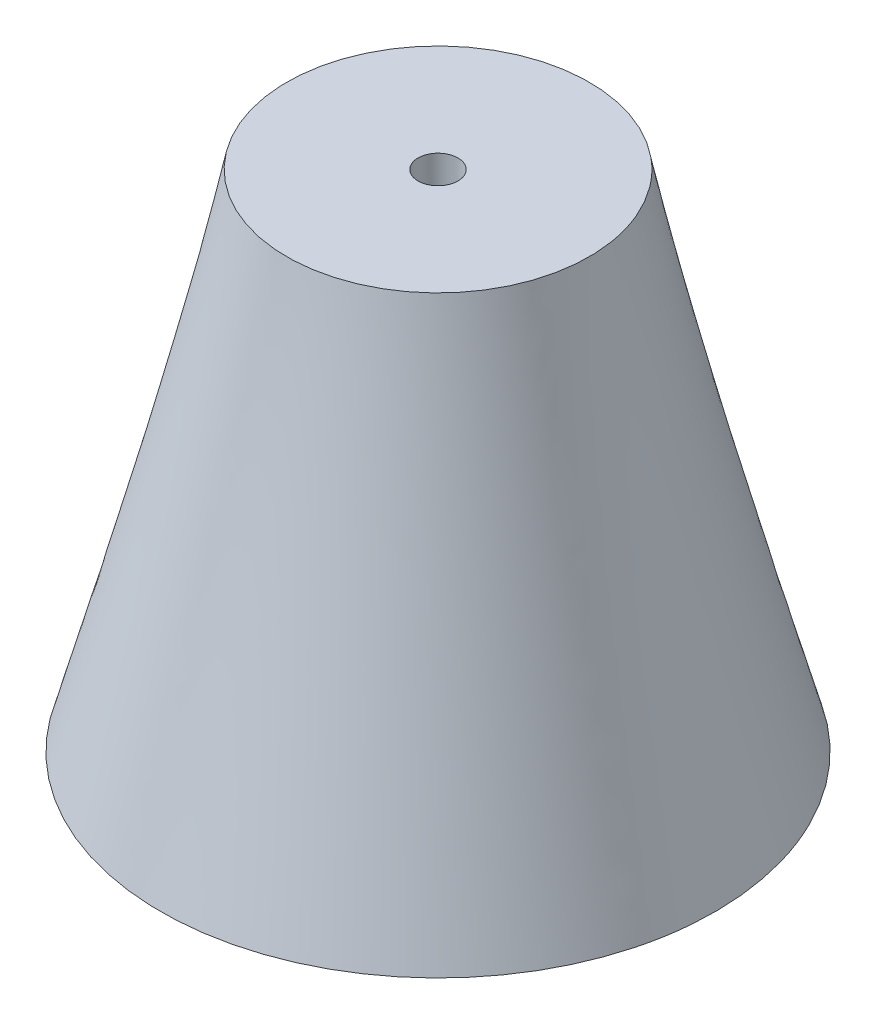
ISO-10303-21;
HEADER;
FILE_DESCRIPTION(('STEP AP214'),'2;1');
FILE_NAME('part.step','',(''),(''),'','','');
FILE_SCHEMA(('AUTOMOTIVE_DESIGN { 1 0 10303 214 1 1 1 1 }'));
ENDSEC;
DATA;
#1=APPLICATION_CONTEXT('core data for automotive mechanical design processes');
#2=APPLICATION_PROTOCOL_DEFINITION('international standard','automotive_design',2000,#1);
#3=PRODUCT_CONTEXT('',#1,'mechanical');
#4=PRODUCT('Part','Part','',(#3));
#5=PRODUCT_RELATED_PRODUCT_CATEGORY('part','',(#4));
#6=PRODUCT_DEFINITION_FORMATION('','',#4);
#7=PRODUCT_DEFINITION_CONTEXT('part definition',#1,'design');
#8=PRODUCT_DEFINITION('design','',#6,#7);
#9=PRODUCT_DEFINITION_SHAPE('','',#8);
#10=(LENGTH_UNIT() NAMED_UNIT(*) SI_UNIT(.MILLI.,.METRE.));
#11=(NAMED_UNIT(*) PLANE_ANGLE_UNIT() SI_UNIT($,.RADIAN.));
#12=(NAMED_UNIT(*) SI_UNIT($,.STERADIAN.) SOLID_ANGLE_UNIT());
#13=UNCERTAINTY_MEASURE_WITH_UNIT(LENGTH_MEASURE(1.E-05),#10,'distance_accuracy_value','');
#14=(GEOMETRIC_REPRESENTATION_CONTEXT(3) GLOBAL_UNCERTAINTY_ASSIGNED_CONTEXT((#13)) GLOBAL_UNIT_ASSIGNED_CONTEXT((#10,
#11,#12)) REPRESENTATION_CONTEXT('',''));
#15=CARTESIAN_POINT('',(0.,0.,0.));
#16=DIRECTION('',(0.,0.,1.));
#17=DIRECTION('',(1.,0.,0.));
#18=AXIS2_PLACEMENT_3D('',#15,#16,#17);
#19=CARTESIAN_POINT('',(3.49148133884313E-13,50.,0.));
#20=DIRECTION('',(0.,-1.,0.));
#21=DIRECTION('',(1.,0.,0.));
#22=AXIS2_PLACEMENT_3D('',#19,#20,#21);
#23=PLANE('',#22);
#24=CARTESIAN_POINT('',(3.49148133884313E-13,50.,0.));
#25=DIRECTION('',(0.,-1.,0.));
#26=DIRECTION('',(1.,0.,0.));
#27=AXIS2_PLACEMENT_3D('',#24,#25,#26);
#28=CIRCLE('',#27,1.98019100000033);
#29=CARTESIAN_POINT('',(1.98019100000068,50.,0.));
#30=VERTEX_POINT('',#29);
#31=EDGE_CURVE('E115',#30,#30,#28,.T.);
#32=ORIENTED_EDGE('',*,*,#31,.T.);
#33=EDGE_LOOP('',(#32));
#34=FACE_BOUND('',#33,.T.);
#35=CARTESIAN_POINT('',(3.49148133884313E-13,50.,0.));
#36=DIRECTION('',(0.,-1.,0.));
#37=DIRECTION('',(1.,0.,0.));
#38=AXIS2_PLACEMENT_3D('',#35,#36,#37);
#39=CIRCLE('',#38,15.0000000000003);
#40=CARTESIAN_POINT('',(-13.0154408138258,50.0000000000001,7.45642678645742));
#41=VERTEX_POINT('',#40);
#42=EDGE_CURVE('E11',#41,#41,#39,.T.);
#43=ORIENTED_EDGE('',*,*,#42,.F.);
#44=EDGE_LOOP('',(#43));
#45=FACE_BOUND('',#44,.T.);
#46=ADVANCED_FACE('F40',(#34,#45),#23,.F.);
#47=CARTESIAN_POINT('',(0.,0.,0.));
#48=DIRECTION('',(0.,1.,0.));
#49=DIRECTION('',(0.,0.,1.));
#50=AXIS2_PLACEMENT_3D('',#47,#48,#49);
#51=PLANE('',#50);
#52=CARTESIAN_POINT('',(0.,0.,0.));
#53=DIRECTION('',(0.,1.,0.));
#54=DIRECTION('',(0.,0.,1.));
#55=AXIS2_PLACEMENT_3D('',#52,#53,#54);
#56=CIRCLE('',#55,27.5);
#57=CARTESIAN_POINT('',(-27.3645996144622,0.,2.7255619494291));
#58=VERTEX_POINT('',#57);
#59=EDGE_CURVE('E48',#58,#58,#56,.T.);
#60=ORIENTED_EDGE('',*,*,#59,.F.);
#61=EDGE_LOOP('',(#60));
#62=FACE_BOUND('',#61,.T.);
#63=ADVANCED_FACE('F74',(#62),#51,.F.);
#64=CARTESIAN_POINT('',(-27.3645996144622,0.,2.7255619494291));
#65=CARTESIAN_POINT('',(-13.0154408138258,50.0000000000001,7.45642678645742));
#66=CARTESIAN_POINT('',(-21.913475715604,0.,57.4547611783535));
#67=CARTESIAN_POINT('',(1.89741275908908,50.,33.4873084141096));
#68=CARTESIAN_POINT('',(32.8157235133204,0.,52.0036372794953));
#69=CARTESIAN_POINT('',(27.9282943867413,49.9999999999998,18.5744548411948));
#70=CARTESIAN_POINT('',(27.3645996144622,0.,-2.7255619494291));
#71=CARTESIAN_POINT('',(13.0154408138264,49.9999999999999,-7.45642678645742));
#72=CARTESIAN_POINT('',(21.913475715604,0.,-57.4547611783535));
#73=CARTESIAN_POINT('',(-1.8974127590884,50.,-33.4873084141096));
#74=CARTESIAN_POINT('',(-32.8157235133204,0.,-52.0036372794953));
#75=CARTESIAN_POINT('',(-27.9282943867406,50.0000000000002,-18.5744548411948));
#76=CARTESIAN_POINT('',(-27.3645996144622,0.,2.7255619494291));
#77=CARTESIAN_POINT('',(-13.0154408138258,50.0000000000001,7.45642678645742));
#78=(BOUNDED_SURFACE() B_SPLINE_SURFACE(3,1,((#64,#65),(#66,#67),(#68,#69),(#70,#71),(#72,#73),
(#74,#75),(#76,#77)),.UNSPECIFIED.,.T.,.F.,.F.) B_SPLINE_SURFACE_WITH_KNOTS((4,3,4),(2,2),(0.,
0.5,1.),(0.,1.),.UNSPECIFIED.) GEOMETRIC_REPRESENTATION_ITEM() RATIONAL_B_SPLINE_SURFACE(((1.,
1.),(0.333333333333333,0.333333333333333),(0.333333333333333,0.333333333333333),(1.,1.),
(0.333333333333333,0.333333333333333),(0.333333333333333,0.333333333333333),(1.,1.))) REPRESENTATION_ITEM('') SURFACE());
#79=CARTESIAN_POINT('',(-27.3645996144622,0.,2.7255619494291));
#80=CARTESIAN_POINT('',(-27.2151292102889,0.520833333333334,2.77484179148148));
#81=CARTESIAN_POINT('',(-27.0656588061156,1.04166666666667,2.82412163353385));
#82=CARTESIAN_POINT('',(-26.766717997769,2.08333333333334,2.92268131763861));
#83=CARTESIAN_POINT('',(-26.6172475935957,2.60416666666667,2.97196115969099));
#84=CARTESIAN_POINT('',(-26.3183067852491,3.64583333333334,3.07052084379575));
#85=CARTESIAN_POINT('',(-26.1688363810758,4.16666666666667,3.11980068584813));
#86=CARTESIAN_POINT('',(-25.8698955727292,5.20833333333334,3.21836036995288));
#87=CARTESIAN_POINT('',(-25.7204251685559,5.72916666666668,3.26764021200526));
#88=CARTESIAN_POINT('',(-25.4214843602093,6.77083333333335,3.36619989611002));
#89=CARTESIAN_POINT('',(-25.272013956036,7.29166666666668,3.41547973816239));
#90=CARTESIAN_POINT('',(-24.9730731476894,8.33333333333335,3.51403942226715));
#91=CARTESIAN_POINT('',(-24.8236027435162,8.85416666666668,3.56331926431953));
#92=CARTESIAN_POINT('',(-24.5246619351696,9.89583333333335,3.66187894842429));
#93=CARTESIAN_POINT('',(-24.3751915309963,10.4166666666667,3.71115879047667));
#94=CARTESIAN_POINT('',(-24.0762507226497,11.4583333333334,3.80971847458142));
#95=CARTESIAN_POINT('',(-23.9267803184764,11.9791666666667,3.8589983166338));
#96=CARTESIAN_POINT('',(-23.6278395101298,13.0208333333334,3.95755800073856));
#97=CARTESIAN_POINT('',(-23.4783691059565,13.5416666666667,4.00683784279093));
#98=CARTESIAN_POINT('',(-23.1794282976099,14.5833333333334,4.10539752689569));
#99=CARTESIAN_POINT('',(-23.0299578934366,15.1041666666667,4.15467736894807));
#100=CARTESIAN_POINT('',(-22.73101708509,16.1458333333334,4.25323705305283));
#101=CARTESIAN_POINT('',(-22.5815466809167,16.6666666666667,4.3025168951052));
#102=CARTESIAN_POINT('',(-22.2826058725701,17.7083333333334,4.40107657920996));
#103=CARTESIAN_POINT('',(-22.1331354683968,18.2291666666667,4.45035642126234));
#104=CARTESIAN_POINT('',(-21.8341946600502,19.2708333333334,4.5489161053671));
#105=CARTESIAN_POINT('',(-21.6847242558769,19.7916666666667,4.59819594741947));
#106=CARTESIAN_POINT('',(-21.3857834475303,20.8333333333334,4.69675563152423));
#107=CARTESIAN_POINT('',(-21.236313043357,21.3541666666667,4.74603547357661));
#108=CARTESIAN_POINT('',(-20.9373722350105,22.3958333333334,4.84459515768137));
#109=CARTESIAN_POINT('',(-20.7879018308372,22.9166666666667,4.89387499973374));
#110=CARTESIAN_POINT('',(-20.4889610224906,23.9583333333334,4.9924346838385));
#111=CARTESIAN_POINT('',(-20.3394906183173,24.4791666666667,5.04171452589088));
#112=CARTESIAN_POINT('',(-20.0405498099707,25.5208333333334,5.14027420999564));
#113=CARTESIAN_POINT('',(-19.8910794057974,26.0416666666667,5.18955405204802));
#114=CARTESIAN_POINT('',(-19.5921385974508,27.0833333333334,5.28811373615277));
#115=CARTESIAN_POINT('',(-19.4426681932775,27.6041666666667,5.33739357820515));
#116=CARTESIAN_POINT('',(-19.1437273849309,28.6458333333334,5.43595326230991));
#117=CARTESIAN_POINT('',(-18.9942569807576,29.1666666666667,5.48523310436229));
#118=CARTESIAN_POINT('',(-18.695316172411,30.2083333333334,5.58379278846704));
#119=CARTESIAN_POINT('',(-18.5458457682377,30.7291666666667,5.63307263051942));
#120=CARTESIAN_POINT('',(-18.2469049598911,31.7708333333334,5.73163231462418));
#121=CARTESIAN_POINT('',(-18.0974345557178,32.2916666666667,5.78091215667656));
#122=CARTESIAN_POINT('',(-17.7984937473712,33.3333333333334,5.87947184078131));
#123=CARTESIAN_POINT('',(-17.6490233431979,33.8541666666667,5.92875168283369));
#124=CARTESIAN_POINT('',(-17.3500825348513,34.8958333333334,6.02731136693845));
#125=CARTESIAN_POINT('',(-17.200612130678,35.4166666666667,6.07659120899083));
#126=CARTESIAN_POINT('',(-16.9016713223315,36.4583333333334,6.17515089309558));
#127=CARTESIAN_POINT('',(-16.7522009181582,36.9791666666667,6.22443073514796));
#128=CARTESIAN_POINT('',(-16.4532601098116,38.0208333333334,6.32299041925272));
#129=CARTESIAN_POINT('',(-16.3037897056383,38.5416666666667,6.3722702613051));
#130=CARTESIAN_POINT('',(-16.0048488972917,39.5833333333334,6.47082994540985));
#131=CARTESIAN_POINT('',(-15.8553784931184,40.1041666666667,6.52010978746223));
#132=CARTESIAN_POINT('',(-15.5564376847718,41.1458333333334,6.61866947156699));
#133=CARTESIAN_POINT('',(-15.4069672805985,41.6666666666667,6.66794931361937));
#134=CARTESIAN_POINT('',(-15.1080264722519,42.7083333333334,6.76650899772412));
#135=CARTESIAN_POINT('',(-14.9585560680786,43.2291666666667,6.8157888397765));
#136=CARTESIAN_POINT('',(-14.659615259732,44.2708333333334,6.91434852388126));
#137=CARTESIAN_POINT('',(-14.5101448555587,44.7916666666667,6.96362836593364));
#138=CARTESIAN_POINT('',(-14.2112040472121,45.8333333333334,7.06218805003839));
#139=CARTESIAN_POINT('',(-14.0617336430388,46.3541666666667,7.11146789209077));
#140=CARTESIAN_POINT('',(-13.7627928346922,47.3958333333334,7.21002757619553));
#141=CARTESIAN_POINT('',(-13.6133224305189,47.9166666666668,7.25930741824791));
#142=CARTESIAN_POINT('',(-13.3143816221723,48.9583333333334,7.35786710235266));
#143=CARTESIAN_POINT('',(-13.164911217999,49.4791666666668,7.40714694440504));
#144=CARTESIAN_POINT('',(-13.0154408138258,50.0000000000001,7.45642678645742));
#145=B_SPLINE_CURVE_WITH_KNOTS('',3,(#79,#80,#81,#82,#83,#84,#85,#86,#87,#88,#89,#90,#91,#92,
#93,#94,#95,#96,#97,#98,#99,#100,#101,#102,#103,#104,#105,#106,#107,#108,#109,#110,#111,#112,
#113,#114,#115,#116,#117,#118,#119,#120,#121,#122,#123,#124,#125,#126,#127,#128,#129,#130,#131,
#132,#133,#134,#135,#136,#137,#138,#139,#140,#141,#142,#143,#144),.UNSPECIFIED.,.F.,.F.,(4,2,2,
2,2,2,2,2,2,2,2,2,2,2,2,2,2,2,2,2,2,2,2,2,2,2,2,2,2,2,2,2,4),(0.,1.63227920130348,
3.26455840260696,4.89683760391045,6.52911680521393,8.16139600651741,9.79367520782089,
11.4259544091244,13.0582336104279,14.6905128117313,16.3227920130348,17.9550712143383,
19.5873504156418,21.2196296169453,22.8519088182487,24.4841880195522,26.1164672208557,
27.7487464221592,29.3810256234627,31.0133048247662,32.6455840260696,34.2778632273731,
35.9101424286766,37.5424216299801,39.1747008312836,40.806980032587,42.4392592338905,
44.071538435194,45.7038176364975,47.336096837801,48.9683760391045,50.600655240408,
52.2329344417114),.UNSPECIFIED.);
#146=EDGE_CURVE('BSEAM83',#58,#41,#145,.T.);
#147=ORIENTED_EDGE('',*,*,#59,.T.);
#148=ORIENTED_EDGE('',*,*,#42,.T.);
#149=ORIENTED_EDGE('',*,*,#146,.T.);
#150=ORIENTED_EDGE('',*,*,#146,.F.);
#151=EDGE_LOOP('',(#147,#149,#148,#150));
#152=FACE_BOUND('',#151,.T.);
#153=ADVANCED_FACE('F83',(#152),#78,.T.);
#154=CARTESIAN_POINT('',(2.79318507107451E-13,40.,0.));
#155=DIRECTION('',(0.,1.,0.));
#156=DIRECTION('',(-1.,0.,0.));
#157=AXIS2_PLACEMENT_3D('',#154,#155,#156);
#158=CYLINDRICAL_SURFACE('',#157,1.98019100000033);
#159=CARTESIAN_POINT('',(2.79318507107451E-13,40.,0.));
#160=DIRECTION('',(0.,-1.,0.));
#161=DIRECTION('',(1.,0.,0.));
#162=AXIS2_PLACEMENT_3D('',#159,#160,#161);
#163=CIRCLE('',#162,1.98019100000033);
#164=CARTESIAN_POINT('',(1.98019100000061,40.,0.));
#165=VERTEX_POINT('',#164);
#166=EDGE_CURVE('E53',#165,#165,#163,.T.);
#167=ORIENTED_EDGE('',*,*,#166,.T.);
#168=EDGE_LOOP('',(#167));
#169=FACE_BOUND('',#168,.T.);
#170=ORIENTED_EDGE('',*,*,#31,.F.);
#171=EDGE_LOOP('',(#170));
#172=FACE_BOUND('',#171,.T.);
#173=ADVANCED_FACE('F85',(#169,#172),#158,.F.);
#174=CARTESIAN_POINT('',(2.79318507107451E-13,40.,0.));
#175=DIRECTION('',(0.,-1.,0.));
#176=DIRECTION('',(1.,0.,0.));
#177=AXIS2_PLACEMENT_3D('',#174,#175,#176);
#178=PLANE('',#177);
#179=ORIENTED_EDGE('',*,*,#166,.F.);
#180=EDGE_LOOP('',(#179));
#181=FACE_BOUND('',#180,.T.);
#182=ADVANCED_FACE('F123',(#181),#178,.F.);
#183=CLOSED_SHELL('',(#46,#63,#153,#173,#182));
#184=MANIFOLD_SOLID_BREP('B2',#183);
#185=ADVANCED_BREP_SHAPE_REPRESENTATION('',(#18,#184),#14);
#186=SHAPE_DEFINITION_REPRESENTATION(#9,#185);
ENDSEC;
END-ISO-10303-21;
